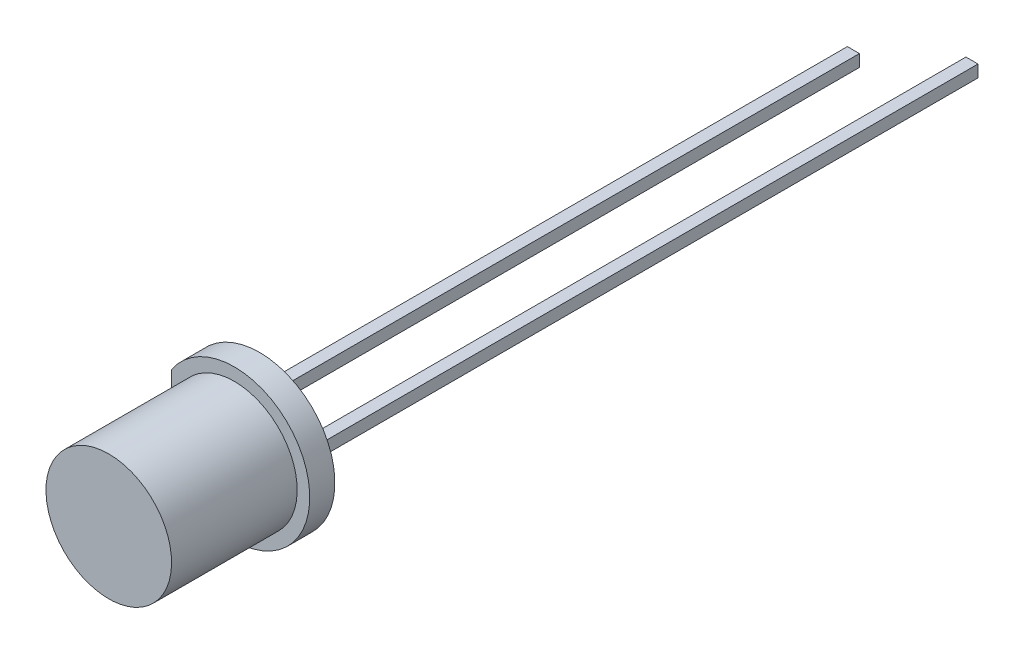
ISO-10303-21;
HEADER;
FILE_DESCRIPTION(('STEP AP214'),'2;1');
FILE_NAME('part.step','',(''),(''),'','','');
FILE_SCHEMA(('AUTOMOTIVE_DESIGN { 1 0 10303 214 1 1 1 1 }'));
ENDSEC;
DATA;
#1=APPLICATION_CONTEXT('core data for automotive mechanical design processes');
#2=APPLICATION_PROTOCOL_DEFINITION('international standard','automotive_design',2000,#1);
#3=PRODUCT_CONTEXT('',#1,'mechanical');
#4=PRODUCT('Part','Part','',(#3));
#5=PRODUCT_RELATED_PRODUCT_CATEGORY('part','',(#4));
#6=PRODUCT_DEFINITION_FORMATION('','',#4);
#7=PRODUCT_DEFINITION_CONTEXT('part definition',#1,'design');
#8=PRODUCT_DEFINITION('design','',#6,#7);
#9=PRODUCT_DEFINITION_SHAPE('','',#8);
#10=(LENGTH_UNIT() NAMED_UNIT(*) SI_UNIT(.MILLI.,.METRE.));
#11=(NAMED_UNIT(*) PLANE_ANGLE_UNIT() SI_UNIT($,.RADIAN.));
#12=(NAMED_UNIT(*) SI_UNIT($,.STERADIAN.) SOLID_ANGLE_UNIT());
#13=UNCERTAINTY_MEASURE_WITH_UNIT(LENGTH_MEASURE(1.E-05),#10,'distance_accuracy_value','');
#14=(GEOMETRIC_REPRESENTATION_CONTEXT(3) GLOBAL_UNCERTAINTY_ASSIGNED_CONTEXT((#13)) GLOBAL_UNIT_ASSIGNED_CONTEXT((#10,
#11,#12)) REPRESENTATION_CONTEXT('',''));
#15=CARTESIAN_POINT('',(0.,0.,0.));
#16=DIRECTION('',(0.,0.,1.));
#17=DIRECTION('',(1.,0.,0.));
#18=AXIS2_PLACEMENT_3D('',#15,#16,#17);
#19=CARTESIAN_POINT('',(-0.0499999999999997,0.,4.26666666666667));
#20=DIRECTION('',(0.,0.,1.));
#21=DIRECTION('',(-1.,0.,0.));
#22=AXIS2_PLACEMENT_3D('',#19,#20,#21);
#23=SPHERICAL_SURFACE('',#22,0.566666666666667);
#24=CARTESIAN_POINT('',(-0.0499999999999997,-0.24,4.26666666666667));
#25=DIRECTION('',(0.,1.,0.));
#26=DIRECTION('',(0.,0.,1.));
#27=AXIS2_PLACEMENT_3D('',#24,#25,#26);
#28=CIRCLE('',#27,0.513333333333333);
#29=CARTESIAN_POINT('',(-0.488634243989226,-0.24,4.));
#30=VERTEX_POINT('',#29);
#31=CARTESIAN_POINT('',(0.388634243989226,-0.24,4.));
#32=VERTEX_POINT('',#31);
#33=EDGE_CURVE('E161',#30,#32,#28,.F.);
#34=ORIENTED_EDGE('',*,*,#33,.T.);
#35=CARTESIAN_POINT('',(-0.0499999999999997,0.,4.));
#36=DIRECTION('',(0.,0.,1.));
#37=DIRECTION('',(1.,0.,0.));
#38=AXIS2_PLACEMENT_3D('',#35,#36,#37);
#39=CIRCLE('',#38,0.5);
#40=EDGE_CURVE('E56',#30,#32,#39,.T.);
#41=ORIENTED_EDGE('',*,*,#40,.F.);
#42=EDGE_LOOP('',(#34,#41));
#43=FACE_BOUND('',#42,.T.);
#44=ADVANCED_FACE('F48',(#43),#23,.T.);
#45=CARTESIAN_POINT('',(0.388634243989226,0.24,4.));
#46=VERTEX_POINT('',#45);
#47=CARTESIAN_POINT('',(-0.488634243989226,0.24,4.));
#48=VERTEX_POINT('',#47);
#49=EDGE_CURVE('E12',#46,#48,#39,.T.);
#50=ORIENTED_EDGE('',*,*,#49,.F.);
#51=CARTESIAN_POINT('',(-0.0499999999999997,0.24,4.26666666666667));
#52=DIRECTION('',(0.,1.,0.));
#53=DIRECTION('',(0.,0.,1.));
#54=AXIS2_PLACEMENT_3D('',#51,#52,#53);
#55=CIRCLE('',#54,0.513333333333333);
#56=EDGE_CURVE('E183',#48,#46,#55,.F.);
#57=ORIENTED_EDGE('',*,*,#56,.F.);
#58=EDGE_LOOP('',(#50,#57));
#59=FACE_BOUND('',#58,.T.);
#60=ADVANCED_FACE('F50',(#59),#23,.T.);
#61=CARTESIAN_POINT('',(-0.55,0.,4.));
#62=DIRECTION('',(0.,0.,-1.));
#63=DIRECTION('',(-1.,0.,0.));
#64=AXIS2_PLACEMENT_3D('',#61,#62,#63);
#65=PLANE('',#64);
#66=CARTESIAN_POINT('',(-0.0499999999999997,0.,4.));
#67=DIRECTION('',(0.,0.,1.));
#68=DIRECTION('',(1.,0.,0.));
#69=AXIS2_PLACEMENT_3D('',#66,#67,#68);
#70=CIRCLE('',#69,0.2);
#71=CARTESIAN_POINT('',(0.15,0.,4.));
#72=VERTEX_POINT('',#71);
#73=EDGE_CURVE('E256',#72,#72,#70,.T.);
#74=ORIENTED_EDGE('',*,*,#73,.F.);
#75=EDGE_LOOP('',(#74));
#76=FACE_BOUND('',#75,.T.);
#77=ORIENTED_EDGE('',*,*,#49,.T.);
#78=DIRECTION('',(1.,0.,0.));
#79=VECTOR('',#78,1.);
#80=CARTESIAN_POINT('',(-1.3,0.24,4.));
#81=LINE('',#80,#79);
#82=CARTESIAN_POINT('',(-1.3,0.24,4.));
#83=VERTEX_POINT('',#82);
#84=EDGE_CURVE('E102',#83,#48,#81,.T.);
#85=ORIENTED_EDGE('',*,*,#84,.F.);
#86=DIRECTION('',(0.,-1.,0.));
#87=VECTOR('',#86,1.);
#88=CARTESIAN_POINT('',(-1.3,0.24,4.));
#89=LINE('',#88,#87);
#90=CARTESIAN_POINT('',(-1.3,-0.24,4.));
#91=VERTEX_POINT('',#90);
#92=EDGE_CURVE('E160',#83,#91,#89,.T.);
#93=ORIENTED_EDGE('',*,*,#92,.T.);
#94=DIRECTION('',(1.,0.,0.));
#95=VECTOR('',#94,1.);
#96=CARTESIAN_POINT('',(-1.3,-0.24,4.));
#97=LINE('',#96,#95);
#98=EDGE_CURVE('E63',#91,#30,#97,.T.);
#99=ORIENTED_EDGE('',*,*,#98,.T.);
#100=ORIENTED_EDGE('',*,*,#40,.T.);
#101=CARTESIAN_POINT('',(1.2,-0.24,4.));
#102=VERTEX_POINT('',#101);
#103=EDGE_CURVE('E146',#32,#102,#97,.T.);
#104=ORIENTED_EDGE('',*,*,#103,.T.);
#105=DIRECTION('',(0.,-1.,0.));
#106=VECTOR('',#105,1.);
#107=CARTESIAN_POINT('',(1.2,0.24,4.));
#108=LINE('',#107,#106);
#109=CARTESIAN_POINT('',(1.2,0.24,4.));
#110=VERTEX_POINT('',#109);
#111=EDGE_CURVE('E130',#110,#102,#108,.T.);
#112=ORIENTED_EDGE('',*,*,#111,.F.);
#113=EDGE_CURVE('E118',#46,#110,#81,.T.);
#114=ORIENTED_EDGE('',*,*,#113,.F.);
#115=EDGE_LOOP('',(#77,#85,#93,#99,#100,#104,#112,#114));
#116=FACE_BOUND('',#115,.T.);
#117=ADVANCED_FACE('F166',(#76,#116),#65,.F.);
#118=CARTESIAN_POINT('',(0.,0.24,0.));
#119=DIRECTION('',(0.,1.,0.));
#120=DIRECTION('',(0.,0.,1.));
#121=AXIS2_PLACEMENT_3D('',#118,#119,#120);
#122=PLANE('',#121);
#123=ORIENTED_EDGE('',*,*,#84,.T.);
#124=ORIENTED_EDGE('',*,*,#56,.T.);
#125=ORIENTED_EDGE('',*,*,#113,.T.);
#126=DIRECTION('',(-0.508148861978286,0.,-0.861269257590315));
#127=VECTOR('',#126,1.);
#128=CARTESIAN_POINT('',(1.2,0.24,4.));
#129=LINE('',#128,#127);
#130=CARTESIAN_POINT('',(0.0199999999999998,0.24,2.));
#131=VERTEX_POINT('',#130);
#132=EDGE_CURVE('E109',#110,#131,#129,.T.);
#133=ORIENTED_EDGE('',*,*,#132,.T.);
#134=DIRECTION('',(-1.,0.,0.));
#135=VECTOR('',#134,1.);
#136=CARTESIAN_POINT('',(0.0199999999999998,0.24,2.));
#137=LINE('',#136,#135);
#138=CARTESIAN_POINT('',(-1.12,0.24,2.));
#139=VERTEX_POINT('',#138);
#140=EDGE_CURVE('E114',#131,#139,#137,.T.);
#141=ORIENTED_EDGE('',*,*,#140,.T.);
#142=DIRECTION('',(0.,0.,-1.));
#143=VECTOR('',#142,1.);
#144=CARTESIAN_POINT('',(-1.12,0.24,2.));
#145=LINE('',#144,#143);
#146=CARTESIAN_POINT('',(-1.12,0.24,-25.));
#147=VERTEX_POINT('',#146);
#148=EDGE_CURVE('E136',#139,#147,#145,.T.);
#149=ORIENTED_EDGE('',*,*,#148,.T.);
#150=DIRECTION('',(1.,0.,0.));
#151=VECTOR('',#150,1.);
#152=CARTESIAN_POINT('',(-1.12,0.24,-25.));
#153=LINE('',#152,#151);
#154=CARTESIAN_POINT('',(-1.6,0.24,-25.));
#155=VERTEX_POINT('',#154);
#156=EDGE_CURVE('E147',#155,#147,#153,.T.);
#157=ORIENTED_EDGE('',*,*,#156,.F.);
#158=DIRECTION('',(0.,0.,1.));
#159=VECTOR('',#158,1.);
#160=CARTESIAN_POINT('',(-1.6,0.24,0.));
#161=LINE('',#160,#159);
#162=CARTESIAN_POINT('',(-1.6,0.24,3.5));
#163=VERTEX_POINT('',#162);
#164=EDGE_CURVE('E72',#155,#163,#161,.T.);
#165=ORIENTED_EDGE('',*,*,#164,.T.);
#166=DIRECTION('',(0.514495755427526,0.,0.857492925712544));
#167=VECTOR('',#166,1.);
#168=CARTESIAN_POINT('',(-1.6,0.24,3.5));
#169=LINE('',#168,#167);
#170=EDGE_CURVE('E156',#163,#83,#169,.T.);
#171=ORIENTED_EDGE('',*,*,#170,.T.);
#172=EDGE_LOOP('',(#123,#124,#125,#133,#141,#149,#157,#165,#171));
#173=FACE_BOUND('',#172,.T.);
#174=ADVANCED_FACE('F111',(#173),#122,.T.);
#175=CARTESIAN_POINT('',(0.,-0.24,0.));
#176=DIRECTION('',(0.,1.,0.));
#177=DIRECTION('',(0.,0.,1.));
#178=AXIS2_PLACEMENT_3D('',#175,#176,#177);
#179=PLANE('',#178);
#180=ORIENTED_EDGE('',*,*,#33,.F.);
#181=ORIENTED_EDGE('',*,*,#98,.F.);
#182=DIRECTION('',(0.514495755427526,0.,0.857492925712544));
#183=VECTOR('',#182,1.);
#184=CARTESIAN_POINT('',(-1.6,-0.24,3.5));
#185=LINE('',#184,#183);
#186=CARTESIAN_POINT('',(-1.6,-0.24,3.5));
#187=VERTEX_POINT('',#186);
#188=EDGE_CURVE('E143',#187,#91,#185,.T.);
#189=ORIENTED_EDGE('',*,*,#188,.F.);
#190=DIRECTION('',(0.,0.,1.));
#191=VECTOR('',#190,1.);
#192=CARTESIAN_POINT('',(-1.6,-0.24,0.));
#193=LINE('',#192,#191);
#194=CARTESIAN_POINT('',(-1.6,-0.24,-25.));
#195=VERTEX_POINT('',#194);
#196=EDGE_CURVE('E96',#195,#187,#193,.T.);
#197=ORIENTED_EDGE('',*,*,#196,.F.);
#198=DIRECTION('',(-1.,0.,0.));
#199=VECTOR('',#198,1.);
#200=CARTESIAN_POINT('',(-1.12,-0.24,-25.));
#201=LINE('',#200,#199);
#202=CARTESIAN_POINT('',(-1.12,-0.24,-25.));
#203=VERTEX_POINT('',#202);
#204=EDGE_CURVE('E204',#203,#195,#201,.T.);
#205=ORIENTED_EDGE('',*,*,#204,.F.);
#206=DIRECTION('',(0.,0.,-1.));
#207=VECTOR('',#206,1.);
#208=CARTESIAN_POINT('',(-1.12,-0.24,2.));
#209=LINE('',#208,#207);
#210=CARTESIAN_POINT('',(-1.12,-0.24,2.));
#211=VERTEX_POINT('',#210);
#212=EDGE_CURVE('E152',#211,#203,#209,.T.);
#213=ORIENTED_EDGE('',*,*,#212,.F.);
#214=DIRECTION('',(-1.,0.,0.));
#215=VECTOR('',#214,1.);
#216=CARTESIAN_POINT('',(0.0199999999999998,-0.24,2.));
#217=LINE('',#216,#215);
#218=CARTESIAN_POINT('',(0.0199999999999998,-0.24,2.));
#219=VERTEX_POINT('',#218);
#220=EDGE_CURVE('E150',#219,#211,#217,.T.);
#221=ORIENTED_EDGE('',*,*,#220,.F.);
#222=DIRECTION('',(-0.508148861978286,0.,-0.861269257590315));
#223=VECTOR('',#222,1.);
#224=CARTESIAN_POINT('',(1.2,-0.24,4.));
#225=LINE('',#224,#223);
#226=EDGE_CURVE('E127',#102,#219,#225,.T.);
#227=ORIENTED_EDGE('',*,*,#226,.F.);
#228=ORIENTED_EDGE('',*,*,#103,.F.);
#229=EDGE_LOOP('',(#180,#181,#189,#197,#205,#213,#221,#227,#228));
#230=FACE_BOUND('',#229,.T.);
#231=ADVANCED_FACE('F218',(#230),#179,.F.);
#232=CARTESIAN_POINT('',(-1.6,0.24,3.5));
#233=DIRECTION('',(0.857492925712544,0.,-0.514495755427526));
#234=DIRECTION('',(-0.514495755427526,0.,-0.857492925712544));
#235=AXIS2_PLACEMENT_3D('',#232,#233,#234);
#236=PLANE('',#235);
#237=ORIENTED_EDGE('',*,*,#188,.T.);
#238=ORIENTED_EDGE('',*,*,#92,.F.);
#239=ORIENTED_EDGE('',*,*,#170,.F.);
#240=DIRECTION('',(0.,-1.,0.));
#241=VECTOR('',#240,1.);
#242=CARTESIAN_POINT('',(-1.6,0.24,3.5));
#243=LINE('',#242,#241);
#244=EDGE_CURVE('E142',#163,#187,#243,.T.);
#245=ORIENTED_EDGE('',*,*,#244,.T.);
#246=EDGE_LOOP('',(#237,#238,#239,#245));
#247=FACE_BOUND('',#246,.T.);
#248=ADVANCED_FACE('F215',(#247),#236,.F.);
#249=CARTESIAN_POINT('',(1.2,0.24,4.));
#250=DIRECTION('',(-0.861269257590315,0.,0.508148861978286));
#251=DIRECTION('',(0.508148861978286,0.,0.861269257590315));
#252=AXIS2_PLACEMENT_3D('',#249,#250,#251);
#253=PLANE('',#252);
#254=ORIENTED_EDGE('',*,*,#226,.T.);
#255=DIRECTION('',(0.,-1.,0.));
#256=VECTOR('',#255,1.);
#257=CARTESIAN_POINT('',(0.0199999999999998,0.24,2.));
#258=LINE('',#257,#256);
#259=EDGE_CURVE('E124',#131,#219,#258,.T.);
#260=ORIENTED_EDGE('',*,*,#259,.F.);
#261=ORIENTED_EDGE('',*,*,#132,.F.);
#262=ORIENTED_EDGE('',*,*,#111,.T.);
#263=EDGE_LOOP('',(#254,#260,#261,#262));
#264=FACE_BOUND('',#263,.T.);
#265=ADVANCED_FACE('F125',(#264),#253,.F.);
#266=CARTESIAN_POINT('',(0.0199999999999998,0.24,2.));
#267=DIRECTION('',(0.,0.,1.));
#268=DIRECTION('',(1.,0.,0.));
#269=AXIS2_PLACEMENT_3D('',#266,#267,#268);
#270=PLANE('',#269);
#271=ORIENTED_EDGE('',*,*,#220,.T.);
#272=DIRECTION('',(0.,-1.,0.));
#273=VECTOR('',#272,1.);
#274=CARTESIAN_POINT('',(-1.12,0.24,2.));
#275=LINE('',#274,#273);
#276=EDGE_CURVE('E131',#139,#211,#275,.T.);
#277=ORIENTED_EDGE('',*,*,#276,.F.);
#278=ORIENTED_EDGE('',*,*,#140,.F.);
#279=ORIENTED_EDGE('',*,*,#259,.T.);
#280=EDGE_LOOP('',(#271,#277,#278,#279));
#281=FACE_BOUND('',#280,.T.);
#282=ADVANCED_FACE('F133',(#281),#270,.F.);
#283=CARTESIAN_POINT('',(-1.12,0.24,2.));
#284=DIRECTION('',(-1.,0.,0.));
#285=DIRECTION('',(0.,0.,1.));
#286=AXIS2_PLACEMENT_3D('',#283,#284,#285);
#287=PLANE('',#286);
#288=ORIENTED_EDGE('',*,*,#212,.T.);
#289=DIRECTION('',(0.,-1.,0.));
#290=VECTOR('',#289,1.);
#291=CARTESIAN_POINT('',(-1.12,-0.24,-25.));
#292=LINE('',#291,#290);
#293=EDGE_CURVE('E198',#147,#203,#292,.T.);
#294=ORIENTED_EDGE('',*,*,#293,.F.);
#295=ORIENTED_EDGE('',*,*,#148,.F.);
#296=ORIENTED_EDGE('',*,*,#276,.T.);
#297=EDGE_LOOP('',(#288,#294,#295,#296));
#298=FACE_BOUND('',#297,.T.);
#299=ADVANCED_FACE('F201',(#298),#287,.F.);
#300=CARTESIAN_POINT('',(-1.6,0.24,0.));
#301=DIRECTION('',(1.,0.,0.));
#302=DIRECTION('',(0.,0.,-1.));
#303=AXIS2_PLACEMENT_3D('',#300,#301,#302);
#304=PLANE('',#303);
#305=ORIENTED_EDGE('',*,*,#196,.T.);
#306=ORIENTED_EDGE('',*,*,#244,.F.);
#307=ORIENTED_EDGE('',*,*,#164,.F.);
#308=DIRECTION('',(0.,1.,0.));
#309=VECTOR('',#308,1.);
#310=CARTESIAN_POINT('',(-1.6,-0.24,-25.));
#311=LINE('',#310,#309);
#312=EDGE_CURVE('E199',#195,#155,#311,.T.);
#313=ORIENTED_EDGE('',*,*,#312,.F.);
#314=EDGE_LOOP('',(#305,#306,#307,#313));
#315=FACE_BOUND('',#314,.T.);
#316=ADVANCED_FACE('F219',(#315),#304,.F.);
#317=CARTESIAN_POINT('',(0.,0.,-25.));
#318=DIRECTION('',(0.,0.,1.));
#319=DIRECTION('',(1.,0.,0.));
#320=AXIS2_PLACEMENT_3D('',#317,#318,#319);
#321=PLANE('',#320);
#322=ORIENTED_EDGE('',*,*,#293,.T.);
#323=ORIENTED_EDGE('',*,*,#204,.T.);
#324=ORIENTED_EDGE('',*,*,#312,.T.);
#325=ORIENTED_EDGE('',*,*,#156,.T.);
#326=EDGE_LOOP('',(#322,#323,#324,#325));
#327=FACE_BOUND('',#326,.T.);
#328=ADVANCED_FACE('F196',(#327),#321,.F.);
#329=CARTESIAN_POINT('',(-0.0499999999999997,0.,3.9));
#330=DIRECTION('',(0.,0.,1.));
#331=DIRECTION('',(1.,0.,0.));
#332=AXIS2_PLACEMENT_3D('',#329,#330,#331);
#333=CYLINDRICAL_SURFACE('',#332,0.2);
#334=CARTESIAN_POINT('',(-0.0499999999999997,0.,3.9));
#335=DIRECTION('',(0.,0.,1.));
#336=DIRECTION('',(1.,0.,0.));
#337=AXIS2_PLACEMENT_3D('',#334,#335,#336);
#338=CIRCLE('',#337,0.2);
#339=CARTESIAN_POINT('',(0.15,0.,3.9));
#340=VERTEX_POINT('',#339);
#341=EDGE_CURVE('E207',#340,#340,#338,.T.);
#342=ORIENTED_EDGE('',*,*,#341,.F.);
#343=EDGE_LOOP('',(#342));
#344=FACE_BOUND('',#343,.T.);
#345=ORIENTED_EDGE('',*,*,#73,.T.);
#346=EDGE_LOOP('',(#345));
#347=FACE_BOUND('',#346,.T.);
#348=ADVANCED_FACE('F226',(#344,#347),#333,.F.);
#349=CARTESIAN_POINT('',(-0.0499999999999997,0.,3.9));
#350=DIRECTION('',(0.,0.,1.));
#351=DIRECTION('',(1.,0.,0.));
#352=AXIS2_PLACEMENT_3D('',#349,#350,#351);
#353=PLANE('',#352);
#354=ORIENTED_EDGE('',*,*,#341,.T.);
#355=EDGE_LOOP('',(#354));
#356=FACE_BOUND('',#355,.T.);
#357=ADVANCED_FACE('F248',(#356),#353,.T.);
#358=CLOSED_SHELL('',(#44,#60,#117,#174,#231,#248,#265,#282,#299,#316,#328,#348,#357));
#359=MANIFOLD_SOLID_BREP('B2',#358);
#360=CARTESIAN_POINT('',(1.12,0.24,2.));
#361=DIRECTION('',(0.,0.,1.));
#362=DIRECTION('',(1.,0.,0.));
#363=AXIS2_PLACEMENT_3D('',#360,#361,#362);
#364=PLANE('',#363);
#365=DIRECTION('',(-1.,0.,0.));
#366=VECTOR('',#365,1.);
#367=CARTESIAN_POINT('',(1.12,-0.24,2.));
#368=LINE('',#367,#366);
#369=CARTESIAN_POINT('',(1.12,-0.24,2.));
#370=VERTEX_POINT('',#369);
#371=CARTESIAN_POINT('',(0.22,-0.24,2.));
#372=VERTEX_POINT('',#371);
#373=EDGE_CURVE('E454',#370,#372,#368,.T.);
#374=ORIENTED_EDGE('',*,*,#373,.T.);
#375=DIRECTION('',(0.,-1.,0.));
#376=VECTOR('',#375,1.);
#377=CARTESIAN_POINT('',(0.22,0.24,2.));
#378=LINE('',#377,#376);
#379=CARTESIAN_POINT('',(0.22,0.24,2.));
#380=VERTEX_POINT('',#379);
#381=EDGE_CURVE('E46',#380,#372,#378,.T.);
#382=ORIENTED_EDGE('',*,*,#381,.F.);
#383=DIRECTION('',(-1.,0.,0.));
#384=VECTOR('',#383,1.);
#385=CARTESIAN_POINT('',(1.12,0.24,2.));
#386=LINE('',#385,#384);
#387=CARTESIAN_POINT('',(1.12,0.24,2.));
#388=VERTEX_POINT('',#387);
#389=EDGE_CURVE('E455',#388,#380,#386,.T.);
#390=ORIENTED_EDGE('',*,*,#389,.F.);
#391=DIRECTION('',(0.,-1.,0.));
#392=VECTOR('',#391,1.);
#393=CARTESIAN_POINT('',(1.12,0.24,2.));
#394=LINE('',#393,#392);
#395=EDGE_CURVE('E460',#388,#370,#394,.T.);
#396=ORIENTED_EDGE('',*,*,#395,.T.);
#397=EDGE_LOOP('',(#374,#382,#390,#396));
#398=FACE_BOUND('',#397,.T.);
#399=ADVANCED_FACE('F368',(#398),#364,.F.);
#400=CARTESIAN_POINT('',(0.22,0.24,2.));
#401=DIRECTION('',(0.861269257590315,0.,-0.508148861978286));
#402=DIRECTION('',(-0.508148861978286,0.,-0.861269257590315));
#403=AXIS2_PLACEMENT_3D('',#400,#401,#402);
#404=PLANE('',#403);
#405=DIRECTION('',(0.508148861978286,0.,0.861269257590315));
#406=VECTOR('',#405,1.);
#407=CARTESIAN_POINT('',(0.22,-0.24,2.));
#408=LINE('',#407,#406);
#409=CARTESIAN_POINT('',(1.4,-0.24,4.));
#410=VERTEX_POINT('',#409);
#411=EDGE_CURVE('E463',#372,#410,#408,.T.);
#412=ORIENTED_EDGE('',*,*,#411,.T.);
#413=DIRECTION('',(0.,-1.,0.));
#414=VECTOR('',#413,1.);
#415=CARTESIAN_POINT('',(1.4,0.24,4.));
#416=LINE('',#415,#414);
#417=CARTESIAN_POINT('',(1.4,0.24,4.));
#418=VERTEX_POINT('',#417);
#419=EDGE_CURVE('E376',#418,#410,#416,.T.);
#420=ORIENTED_EDGE('',*,*,#419,.F.);
#421=DIRECTION('',(0.508148861978286,0.,0.861269257590315));
#422=VECTOR('',#421,1.);
#423=CARTESIAN_POINT('',(0.22,0.24,2.));
#424=LINE('',#423,#422);
#425=EDGE_CURVE('E417',#380,#418,#424,.T.);
#426=ORIENTED_EDGE('',*,*,#425,.F.);
#427=ORIENTED_EDGE('',*,*,#381,.T.);
#428=EDGE_LOOP('',(#412,#420,#426,#427));
#429=FACE_BOUND('',#428,.T.);
#430=ADVANCED_FACE('F478',(#429),#404,.F.);
#431=CARTESIAN_POINT('',(1.4,0.24,4.));
#432=DIRECTION('',(0.,0.,-1.));
#433=DIRECTION('',(-1.,0.,0.));
#434=AXIS2_PLACEMENT_3D('',#431,#432,#433);
#435=PLANE('',#434);
#436=DIRECTION('',(1.,0.,0.));
#437=VECTOR('',#436,1.);
#438=CARTESIAN_POINT('',(1.4,-0.24,4.));
#439=LINE('',#438,#437);
#440=CARTESIAN_POINT('',(1.6,-0.24,4.));
#441=VERTEX_POINT('',#440);
#442=EDGE_CURVE('E403',#410,#441,#439,.T.);
#443=ORIENTED_EDGE('',*,*,#442,.T.);
#444=DIRECTION('',(0.,-1.,0.));
#445=VECTOR('',#444,1.);
#446=CARTESIAN_POINT('',(1.6,0.24,4.));
#447=LINE('',#446,#445);
#448=CARTESIAN_POINT('',(1.6,0.24,4.));
#449=VERTEX_POINT('',#448);
#450=EDGE_CURVE('E469',#449,#441,#447,.T.);
#451=ORIENTED_EDGE('',*,*,#450,.F.);
#452=DIRECTION('',(1.,0.,0.));
#453=VECTOR('',#452,1.);
#454=CARTESIAN_POINT('',(1.4,0.24,4.));
#455=LINE('',#454,#453);
#456=EDGE_CURVE('E434',#418,#449,#455,.T.);
#457=ORIENTED_EDGE('',*,*,#456,.F.);
#458=ORIENTED_EDGE('',*,*,#419,.T.);
#459=EDGE_LOOP('',(#443,#451,#457,#458));
#460=FACE_BOUND('',#459,.T.);
#461=ADVANCED_FACE('F470',(#460),#435,.F.);
#462=CARTESIAN_POINT('',(1.6,0.24,4.));
#463=DIRECTION('',(-1.,0.,0.));
#464=DIRECTION('',(0.,0.,1.));
#465=AXIS2_PLACEMENT_3D('',#462,#463,#464);
#466=PLANE('',#465);
#467=DIRECTION('',(0.,0.,-1.));
#468=VECTOR('',#467,1.);
#469=CARTESIAN_POINT('',(1.6,-0.24,4.));
#470=LINE('',#469,#468);
#471=CARTESIAN_POINT('',(1.6,-0.24,-27.));
#472=VERTEX_POINT('',#471);
#473=EDGE_CURVE('E441',#441,#472,#470,.T.);
#474=ORIENTED_EDGE('',*,*,#473,.T.);
#475=DIRECTION('',(0.,-1.,0.));
#476=VECTOR('',#475,1.);
#477=CARTESIAN_POINT('',(1.6,0.24,-27.));
#478=LINE('',#477,#476);
#479=CARTESIAN_POINT('',(1.6,0.24,-27.));
#480=VERTEX_POINT('',#479);
#481=EDGE_CURVE('E438',#480,#472,#478,.T.);
#482=ORIENTED_EDGE('',*,*,#481,.F.);
#483=DIRECTION('',(0.,0.,-1.));
#484=VECTOR('',#483,1.);
#485=CARTESIAN_POINT('',(1.6,0.24,4.));
#486=LINE('',#485,#484);
#487=EDGE_CURVE('E428',#449,#480,#486,.T.);
#488=ORIENTED_EDGE('',*,*,#487,.F.);
#489=ORIENTED_EDGE('',*,*,#450,.T.);
#490=EDGE_LOOP('',(#474,#482,#488,#489));
#491=FACE_BOUND('',#490,.T.);
#492=ADVANCED_FACE('F439',(#491),#466,.F.);
#493=CARTESIAN_POINT('',(1.12,0.24,0.));
#494=DIRECTION('',(1.,0.,0.));
#495=DIRECTION('',(0.,0.,-1.));
#496=AXIS2_PLACEMENT_3D('',#493,#494,#495);
#497=PLANE('',#496);
#498=DIRECTION('',(0.,0.,1.));
#499=VECTOR('',#498,1.);
#500=CARTESIAN_POINT('',(1.12,-0.24,0.));
#501=LINE('',#500,#499);
#502=CARTESIAN_POINT('',(1.12,-0.24,-27.));
#503=VERTEX_POINT('',#502);
#504=EDGE_CURVE('E410',#503,#370,#501,.T.);
#505=ORIENTED_EDGE('',*,*,#504,.T.);
#506=ORIENTED_EDGE('',*,*,#395,.F.);
#507=DIRECTION('',(0.,0.,1.));
#508=VECTOR('',#507,1.);
#509=CARTESIAN_POINT('',(1.12,0.24,0.));
#510=LINE('',#509,#508);
#511=CARTESIAN_POINT('',(1.12,0.24,-27.));
#512=VERTEX_POINT('',#511);
#513=EDGE_CURVE('E384',#512,#388,#510,.T.);
#514=ORIENTED_EDGE('',*,*,#513,.F.);
#515=DIRECTION('',(0.,1.,0.));
#516=VECTOR('',#515,1.);
#517=CARTESIAN_POINT('',(1.12,-0.24,-27.));
#518=LINE('',#517,#516);
#519=EDGE_CURVE('E449',#503,#512,#518,.T.);
#520=ORIENTED_EDGE('',*,*,#519,.F.);
#521=EDGE_LOOP('',(#505,#506,#514,#520));
#522=FACE_BOUND('',#521,.T.);
#523=ADVANCED_FACE('F474',(#522),#497,.F.);
#524=CARTESIAN_POINT('',(0.,0.24,0.));
#525=DIRECTION('',(0.,-1.,0.));
#526=DIRECTION('',(0.,0.,-1.));
#527=AXIS2_PLACEMENT_3D('',#524,#525,#526);
#528=PLANE('',#527);
#529=ORIENTED_EDGE('',*,*,#389,.T.);
#530=ORIENTED_EDGE('',*,*,#425,.T.);
#531=ORIENTED_EDGE('',*,*,#456,.T.);
#532=ORIENTED_EDGE('',*,*,#487,.T.);
#533=DIRECTION('',(1.,0.,0.));
#534=VECTOR('',#533,1.);
#535=CARTESIAN_POINT('',(1.12,0.24,-27.));
#536=LINE('',#535,#534);
#537=EDGE_CURVE('E432',#512,#480,#536,.T.);
#538=ORIENTED_EDGE('',*,*,#537,.F.);
#539=ORIENTED_EDGE('',*,*,#513,.T.);
#540=EDGE_LOOP('',(#529,#530,#531,#532,#538,#539));
#541=FACE_BOUND('',#540,.T.);
#542=ADVANCED_FACE('F430',(#541),#528,.F.);
#543=CARTESIAN_POINT('',(0.,-0.24,0.));
#544=DIRECTION('',(0.,-1.,0.));
#545=DIRECTION('',(0.,0.,-1.));
#546=AXIS2_PLACEMENT_3D('',#543,#544,#545);
#547=PLANE('',#546);
#548=ORIENTED_EDGE('',*,*,#373,.F.);
#549=ORIENTED_EDGE('',*,*,#504,.F.);
#550=DIRECTION('',(-1.,0.,0.));
#551=VECTOR('',#550,1.);
#552=CARTESIAN_POINT('',(1.6,-0.24,-27.));
#553=LINE('',#552,#551);
#554=EDGE_CURVE('E445',#472,#503,#553,.T.);
#555=ORIENTED_EDGE('',*,*,#554,.F.);
#556=ORIENTED_EDGE('',*,*,#473,.F.);
#557=ORIENTED_EDGE('',*,*,#442,.F.);
#558=ORIENTED_EDGE('',*,*,#411,.F.);
#559=EDGE_LOOP('',(#548,#549,#555,#556,#557,#558));
#560=FACE_BOUND('',#559,.T.);
#561=ADVANCED_FACE('F473',(#560),#547,.T.);
#562=CARTESIAN_POINT('',(0.,0.,-27.));
#563=DIRECTION('',(0.,0.,-1.));
#564=DIRECTION('',(-1.,0.,0.));
#565=AXIS2_PLACEMENT_3D('',#562,#563,#564);
#566=PLANE('',#565);
#567=ORIENTED_EDGE('',*,*,#537,.T.);
#568=ORIENTED_EDGE('',*,*,#481,.T.);
#569=ORIENTED_EDGE('',*,*,#554,.T.);
#570=ORIENTED_EDGE('',*,*,#519,.T.);
#571=EDGE_LOOP('',(#567,#568,#569,#570));
#572=FACE_BOUND('',#571,.T.);
#573=ADVANCED_FACE('F448',(#572),#566,.T.);
#574=CLOSED_SHELL('',(#399,#430,#461,#492,#523,#542,#561,#573));
#575=MANIFOLD_SOLID_BREP('B6',#574);
#576=CARTESIAN_POINT('',(0.,0.,1.));
#577=DIRECTION('',(0.,0.,-1.));
#578=DIRECTION('',(-1.,0.,0.));
#579=AXIS2_PLACEMENT_3D('',#576,#577,#578);
#580=CYLINDRICAL_SURFACE('',#579,3.);
#581=CARTESIAN_POINT('',(0.,0.,1.));
#582=DIRECTION('',(0.,0.,1.));
#583=DIRECTION('',(1.,0.,0.));
#584=AXIS2_PLACEMENT_3D('',#581,#582,#583);
#585=CIRCLE('',#584,3.);
#586=CARTESIAN_POINT('',(-2.5,-1.6583123951777,1.));
#587=VERTEX_POINT('',#586);
#588=CARTESIAN_POINT('',(-2.5,1.6583123951777,1.));
#589=VERTEX_POINT('',#588);
#590=EDGE_CURVE('E580',#587,#589,#585,.T.);
#591=ORIENTED_EDGE('',*,*,#590,.F.);
#592=DIRECTION('',(0.,0.,-1.));
#593=VECTOR('',#592,1.);
#594=CARTESIAN_POINT('',(-2.5,-1.6583123951777,4.35410196624969));
#595=LINE('',#594,#593);
#596=CARTESIAN_POINT('',(-2.5,-1.6583123951777,0.));
#597=VERTEX_POINT('',#596);
#598=EDGE_CURVE('E778',#587,#597,#595,.T.);
#599=ORIENTED_EDGE('',*,*,#598,.T.);
#600=CARTESIAN_POINT('',(0.,0.,0.));
#601=DIRECTION('',(0.,0.,1.));
#602=DIRECTION('',(1.,0.,0.));
#603=AXIS2_PLACEMENT_3D('',#600,#601,#602);
#604=CIRCLE('',#603,3.);
#605=CARTESIAN_POINT('',(-2.5,1.6583123951777,0.));
#606=VERTEX_POINT('',#605);
#607=EDGE_CURVE('E786',#597,#606,#604,.T.);
#608=ORIENTED_EDGE('',*,*,#607,.T.);
#609=DIRECTION('',(0.,0.,-1.));
#610=VECTOR('',#609,1.);
#611=CARTESIAN_POINT('',(-2.5,1.6583123951777,4.35410196624969));
#612=LINE('',#611,#610);
#613=EDGE_CURVE('E781',#589,#606,#612,.T.);
#614=ORIENTED_EDGE('',*,*,#613,.F.);
#615=EDGE_LOOP('',(#591,#599,#608,#614));
#616=FACE_BOUND('',#615,.T.);
#617=ADVANCED_FACE('F573',(#616),#580,.T.);
#618=CARTESIAN_POINT('',(0.,0.,1.));
#619=DIRECTION('',(0.,0.,1.));
#620=DIRECTION('',(1.,0.,0.));
#621=AXIS2_PLACEMENT_3D('',#618,#619,#620);
#622=PLANE('',#621);
#623=DIRECTION('',(0.,-1.,0.));
#624=VECTOR('',#623,1.);
#625=CARTESIAN_POINT('',(-2.5,1.6583123951777,1.));
#626=LINE('',#625,#624);
#627=CARTESIAN_POINT('',(-2.5,0.,1.));
#628=VERTEX_POINT('',#627);
#629=EDGE_CURVE('E774',#628,#587,#626,.T.);
#630=ORIENTED_EDGE('',*,*,#629,.T.);
#631=ORIENTED_EDGE('',*,*,#590,.T.);
#632=EDGE_CURVE('E775',#589,#628,#626,.T.);
#633=ORIENTED_EDGE('',*,*,#632,.T.);
#634=CARTESIAN_POINT('',(0.,0.,1.));
#635=DIRECTION('',(0.,0.,1.));
#636=DIRECTION('',(1.,0.,0.));
#637=AXIS2_PLACEMENT_3D('',#634,#635,#636);
#638=CIRCLE('',#637,2.5);
#639=EDGE_CURVE('E366',#628,#628,#638,.T.);
#640=ORIENTED_EDGE('',*,*,#639,.F.);
#641=EDGE_LOOP('',(#630,#631,#633,#640));
#642=FACE_BOUND('',#641,.T.);
#643=ADVANCED_FACE('F800',(#642),#622,.T.);
#644=CARTESIAN_POINT('',(0.,0.,0.));
#645=DIRECTION('',(0.,0.,1.));
#646=DIRECTION('',(1.,0.,0.));
#647=AXIS2_PLACEMENT_3D('',#644,#645,#646);
#648=PLANE('',#647);
#649=DIRECTION('',(0.,1.,0.));
#650=VECTOR('',#649,1.);
#651=CARTESIAN_POINT('',(1.12,-0.24,0.));
#652=LINE('',#651,#650);
#653=CARTESIAN_POINT('',(1.12,-0.24,0.));
#654=VERTEX_POINT('',#653);
#655=CARTESIAN_POINT('',(1.12,0.24,0.));
#656=VERTEX_POINT('',#655);
#657=EDGE_CURVE('E687',#654,#656,#652,.T.);
#658=ORIENTED_EDGE('',*,*,#657,.F.);
#659=DIRECTION('',(-1.,0.,0.));
#660=VECTOR('',#659,1.);
#661=CARTESIAN_POINT('',(1.12,-0.24,0.));
#662=LINE('',#661,#660);
#663=CARTESIAN_POINT('',(1.6,-0.24,0.));
#664=VERTEX_POINT('',#663);
#665=EDGE_CURVE('E694',#664,#654,#662,.T.);
#666=ORIENTED_EDGE('',*,*,#665,.F.);
#667=DIRECTION('',(0.,1.,0.));
#668=VECTOR('',#667,1.);
#669=CARTESIAN_POINT('',(1.6,-0.24,0.));
#670=LINE('',#669,#668);
#671=CARTESIAN_POINT('',(1.6,0.24,0.));
#672=VERTEX_POINT('',#671);
#673=EDGE_CURVE('E742',#664,#672,#670,.T.);
#674=ORIENTED_EDGE('',*,*,#673,.T.);
#675=DIRECTION('',(-1.,0.,0.));
#676=VECTOR('',#675,1.);
#677=CARTESIAN_POINT('',(1.12,0.24,0.));
#678=LINE('',#677,#676);
#679=EDGE_CURVE('E708',#672,#656,#678,.T.);
#680=ORIENTED_EDGE('',*,*,#679,.T.);
#681=EDGE_LOOP('',(#658,#666,#674,#680));
#682=FACE_BOUND('',#681,.T.);
#683=DIRECTION('',(0.,1.,0.));
#684=VECTOR('',#683,1.);
#685=CARTESIAN_POINT('',(-1.6,-0.24,0.));
#686=LINE('',#685,#684);
#687=CARTESIAN_POINT('',(-1.6,-0.24,0.));
#688=VERTEX_POINT('',#687);
#689=CARTESIAN_POINT('',(-1.6,0.24,0.));
#690=VERTEX_POINT('',#689);
#691=EDGE_CURVE('E738',#688,#690,#686,.T.);
#692=ORIENTED_EDGE('',*,*,#691,.F.);
#693=DIRECTION('',(-1.,0.,0.));
#694=VECTOR('',#693,1.);
#695=CARTESIAN_POINT('',(-1.6,-0.24,0.));
#696=LINE('',#695,#694);
#697=CARTESIAN_POINT('',(-1.12,-0.24,0.));
#698=VERTEX_POINT('',#697);
#699=EDGE_CURVE('E716',#698,#688,#696,.T.);
#700=ORIENTED_EDGE('',*,*,#699,.F.);
#701=DIRECTION('',(0.,1.,0.));
#702=VECTOR('',#701,1.);
#703=CARTESIAN_POINT('',(-1.12,-0.24,0.));
#704=LINE('',#703,#702);
#705=CARTESIAN_POINT('',(-1.12,0.24,0.));
#706=VERTEX_POINT('',#705);
#707=EDGE_CURVE('E758',#698,#706,#704,.T.);
#708=ORIENTED_EDGE('',*,*,#707,.T.);
#709=DIRECTION('',(-1.,0.,0.));
#710=VECTOR('',#709,1.);
#711=CARTESIAN_POINT('',(-1.6,0.24,0.));
#712=LINE('',#711,#710);
#713=EDGE_CURVE('E739',#706,#690,#712,.T.);
#714=ORIENTED_EDGE('',*,*,#713,.T.);
#715=EDGE_LOOP('',(#692,#700,#708,#714));
#716=FACE_BOUND('',#715,.T.);
#717=ORIENTED_EDGE('',*,*,#607,.F.);
#718=DIRECTION('',(0.,-1.,0.));
#719=VECTOR('',#718,1.);
#720=CARTESIAN_POINT('',(-2.5,1.6583123951777,0.));
#721=LINE('',#720,#719);
#722=EDGE_CURVE('E761',#606,#597,#721,.T.);
#723=ORIENTED_EDGE('',*,*,#722,.F.);
#724=EDGE_LOOP('',(#717,#723));
#725=FACE_BOUND('',#724,.T.);
#726=ADVANCED_FACE('F706',(#682,#716,#725),#648,.F.);
#727=CARTESIAN_POINT('',(0.,0.,6.));
#728=DIRECTION('',(0.,0.,1.));
#729=DIRECTION('',(0.,-1.,0.));
#730=AXIS2_PLACEMENT_3D('',#727,#728,#729);
#731=PLANE('',#730);
#732=CARTESIAN_POINT('',(0.,0.,6.));
#733=DIRECTION('',(0.,0.,-1.));
#734=DIRECTION('',(0.,1.,0.));
#735=AXIS2_PLACEMENT_3D('',#732,#733,#734);
#736=CIRCLE('',#735,2.5);
#737=CARTESIAN_POINT('',(0.,2.5,6.));
#738=VERTEX_POINT('',#737);
#739=EDGE_CURVE('E783',#738,#738,#736,.T.);
#740=ORIENTED_EDGE('',*,*,#739,.F.);
#741=EDGE_LOOP('',(#740));
#742=FACE_BOUND('',#741,.T.);
#743=ADVANCED_FACE('F804',(#742),#731,.T.);
#744=CARTESIAN_POINT('',(0.,0.,1.));
#745=DIRECTION('',(0.,0.,-1.));
#746=DIRECTION('',(0.,1.,0.));
#747=AXIS2_PLACEMENT_3D('',#744,#745,#746);
#748=CYLINDRICAL_SURFACE('',#747,2.5);
#749=ORIENTED_EDGE('',*,*,#739,.T.);
#750=EDGE_LOOP('',(#749));
#751=FACE_BOUND('',#750,.T.);
#752=ORIENTED_EDGE('',*,*,#639,.T.);
#753=EDGE_LOOP('',(#752));
#754=FACE_BOUND('',#753,.T.);
#755=ADVANCED_FACE('F802',(#751,#754),#748,.T.);
#756=CARTESIAN_POINT('',(-2.5,1.6583123951777,4.35410196624969));
#757=DIRECTION('',(1.,0.,0.));
#758=DIRECTION('',(0.,0.,-1.));
#759=AXIS2_PLACEMENT_3D('',#756,#757,#758);
#760=PLANE('',#759);
#761=ORIENTED_EDGE('',*,*,#613,.T.);
#762=ORIENTED_EDGE('',*,*,#722,.T.);
#763=ORIENTED_EDGE('',*,*,#598,.F.);
#764=ORIENTED_EDGE('',*,*,#629,.F.);
#765=ORIENTED_EDGE('',*,*,#632,.F.);
#766=EDGE_LOOP('',(#761,#762,#763,#764,#765));
#767=FACE_BOUND('',#766,.T.);
#768=ADVANCED_FACE('F796',(#767),#760,.F.);
#769=CARTESIAN_POINT('',(-1.12,-0.24,0.));
#770=DIRECTION('',(1.,0.,0.));
#771=DIRECTION('',(0.,0.,-1.));
#772=AXIS2_PLACEMENT_3D('',#769,#770,#771);
#773=PLANE('',#772);
#774=DIRECTION('',(0.,0.,-1.));
#775=VECTOR('',#774,1.);
#776=CARTESIAN_POINT('',(-1.12,0.24,0.));
#777=LINE('',#776,#775);
#778=CARTESIAN_POINT('',(-1.12,0.24,2.));
#779=VERTEX_POINT('',#778);
#780=EDGE_CURVE('E720',#779,#706,#777,.T.);
#781=ORIENTED_EDGE('',*,*,#780,.T.);
#782=ORIENTED_EDGE('',*,*,#707,.F.);
#783=DIRECTION('',(0.,0.,-1.));
#784=VECTOR('',#783,1.);
#785=CARTESIAN_POINT('',(-1.12,-0.24,0.));
#786=LINE('',#785,#784);
#787=CARTESIAN_POINT('',(-1.12,-0.24,2.));
#788=VERTEX_POINT('',#787);
#789=EDGE_CURVE('E735',#788,#698,#786,.T.);
#790=ORIENTED_EDGE('',*,*,#789,.F.);
#791=DIRECTION('',(0.,1.,0.));
#792=VECTOR('',#791,1.);
#793=CARTESIAN_POINT('',(-1.12,-0.24,2.));
#794=LINE('',#793,#792);
#795=EDGE_CURVE('E762',#788,#779,#794,.T.);
#796=ORIENTED_EDGE('',*,*,#795,.T.);
#797=EDGE_LOOP('',(#781,#782,#790,#796));
#798=FACE_BOUND('',#797,.T.);
#799=ADVANCED_FACE('F811',(#798),#773,.F.);
#800=CARTESIAN_POINT('',(-1.12,-0.24,2.));
#801=DIRECTION('',(0.,0.,-1.));
#802=DIRECTION('',(-1.,0.,0.));
#803=AXIS2_PLACEMENT_3D('',#800,#801,#802);
#804=PLANE('',#803);
#805=DIRECTION('',(-1.,0.,0.));
#806=VECTOR('',#805,1.);
#807=CARTESIAN_POINT('',(-1.12,0.24,2.));
#808=LINE('',#807,#806);
#809=CARTESIAN_POINT('',(0.0199999999999998,0.24,2.));
#810=VERTEX_POINT('',#809);
#811=EDGE_CURVE('E753',#810,#779,#808,.T.);
#812=ORIENTED_EDGE('',*,*,#811,.T.);
#813=ORIENTED_EDGE('',*,*,#795,.F.);
#814=DIRECTION('',(-1.,0.,0.));
#815=VECTOR('',#814,1.);
#816=CARTESIAN_POINT('',(-1.12,-0.24,2.));
#817=LINE('',#816,#815);
#818=CARTESIAN_POINT('',(0.0199999999999998,-0.24,2.));
#819=VERTEX_POINT('',#818);
#820=EDGE_CURVE('E732',#819,#788,#817,.T.);
#821=ORIENTED_EDGE('',*,*,#820,.F.);
#822=DIRECTION('',(0.,1.,0.));
#823=VECTOR('',#822,1.);
#824=CARTESIAN_POINT('',(0.0199999999999998,-0.24,2.));
#825=LINE('',#824,#823);
#826=EDGE_CURVE('E764',#819,#810,#825,.T.);
#827=ORIENTED_EDGE('',*,*,#826,.T.);
#828=EDGE_LOOP('',(#812,#813,#821,#827));
#829=FACE_BOUND('',#828,.T.);
#830=ADVANCED_FACE('F856',(#829),#804,.F.);
#831=CARTESIAN_POINT('',(0.0199999999999998,-0.24,2.));
#832=DIRECTION('',(0.861269257590315,0.,-0.508148861978286));
#833=DIRECTION('',(-0.508148861978286,0.,-0.861269257590315));
#834=AXIS2_PLACEMENT_3D('',#831,#832,#833);
#835=PLANE('',#834);
#836=DIRECTION('',(-0.508148861978286,0.,-0.861269257590315));
#837=VECTOR('',#836,1.);
#838=CARTESIAN_POINT('',(0.0199999999999998,0.24,2.));
#839=LINE('',#838,#837);
#840=CARTESIAN_POINT('',(1.2,0.24,4.));
#841=VERTEX_POINT('',#840);
#842=EDGE_CURVE('E750',#841,#810,#839,.T.);
#843=ORIENTED_EDGE('',*,*,#842,.T.);
#844=ORIENTED_EDGE('',*,*,#826,.F.);
#845=DIRECTION('',(-0.508148861978286,0.,-0.861269257590315));
#846=VECTOR('',#845,1.);
#847=CARTESIAN_POINT('',(0.0199999999999998,-0.24,2.));
#848=LINE('',#847,#846);
#849=CARTESIAN_POINT('',(1.2,-0.24,4.));
#850=VERTEX_POINT('',#849);
#851=EDGE_CURVE('E729',#850,#819,#848,.T.);
#852=ORIENTED_EDGE('',*,*,#851,.F.);
#853=DIRECTION('',(0.,1.,0.));
#854=VECTOR('',#853,1.);
#855=CARTESIAN_POINT('',(1.2,-0.24,4.));
#856=LINE('',#855,#854);
#857=EDGE_CURVE('E766',#850,#841,#856,.T.);
#858=ORIENTED_EDGE('',*,*,#857,.T.);
#859=EDGE_LOOP('',(#843,#844,#852,#858));
#860=FACE_BOUND('',#859,.T.);
#861=ADVANCED_FACE('F863',(#860),#835,.F.);
#862=CARTESIAN_POINT('',(1.2,-0.24,4.));
#863=DIRECTION('',(0.,0.,1.));
#864=DIRECTION('',(1.,0.,0.));
#865=AXIS2_PLACEMENT_3D('',#862,#863,#864);
#866=PLANE('',#865);
#867=DIRECTION('',(1.,0.,0.));
#868=VECTOR('',#867,1.);
#869=CARTESIAN_POINT('',(1.2,0.24,4.));
#870=LINE('',#869,#868);
#871=CARTESIAN_POINT('',(-1.3,0.24,4.));
#872=VERTEX_POINT('',#871);
#873=EDGE_CURVE('E747',#872,#841,#870,.T.);
#874=ORIENTED_EDGE('',*,*,#873,.T.);
#875=ORIENTED_EDGE('',*,*,#857,.F.);
#876=DIRECTION('',(1.,0.,0.));
#877=VECTOR('',#876,1.);
#878=CARTESIAN_POINT('',(1.2,-0.24,4.));
#879=LINE('',#878,#877);
#880=CARTESIAN_POINT('',(-1.3,-0.24,4.));
#881=VERTEX_POINT('',#880);
#882=EDGE_CURVE('E726',#881,#850,#879,.T.);
#883=ORIENTED_EDGE('',*,*,#882,.F.);
#884=DIRECTION('',(0.,1.,0.));
#885=VECTOR('',#884,1.);
#886=CARTESIAN_POINT('',(-1.3,-0.24,4.));
#887=LINE('',#886,#885);
#888=EDGE_CURVE('E768',#881,#872,#887,.T.);
#889=ORIENTED_EDGE('',*,*,#888,.T.);
#890=EDGE_LOOP('',(#874,#875,#883,#889));
#891=FACE_BOUND('',#890,.T.);
#892=ADVANCED_FACE('F871',(#891),#866,.F.);
#893=CARTESIAN_POINT('',(-1.3,-0.24,4.));
#894=DIRECTION('',(-0.857492925712544,0.,0.514495755427526));
#895=DIRECTION('',(0.514495755427526,0.,0.857492925712544));
#896=AXIS2_PLACEMENT_3D('',#893,#894,#895);
#897=PLANE('',#896);
#898=DIRECTION('',(0.514495755427526,0.,0.857492925712544));
#899=VECTOR('',#898,1.);
#900=CARTESIAN_POINT('',(-1.3,0.24,4.));
#901=LINE('',#900,#899);
#902=CARTESIAN_POINT('',(-1.6,0.24,3.5));
#903=VERTEX_POINT('',#902);
#904=EDGE_CURVE('E744',#903,#872,#901,.T.);
#905=ORIENTED_EDGE('',*,*,#904,.T.);
#906=ORIENTED_EDGE('',*,*,#888,.F.);
#907=DIRECTION('',(0.514495755427526,0.,0.857492925712544));
#908=VECTOR('',#907,1.);
#909=CARTESIAN_POINT('',(-1.3,-0.24,4.));
#910=LINE('',#909,#908);
#911=CARTESIAN_POINT('',(-1.6,-0.24,3.5));
#912=VERTEX_POINT('',#911);
#913=EDGE_CURVE('E723',#912,#881,#910,.T.);
#914=ORIENTED_EDGE('',*,*,#913,.F.);
#915=DIRECTION('',(0.,1.,0.));
#916=VECTOR('',#915,1.);
#917=CARTESIAN_POINT('',(-1.6,-0.24,3.5));
#918=LINE('',#917,#916);
#919=EDGE_CURVE('E770',#912,#903,#918,.T.);
#920=ORIENTED_EDGE('',*,*,#919,.T.);
#921=EDGE_LOOP('',(#905,#906,#914,#920));
#922=FACE_BOUND('',#921,.T.);
#923=ADVANCED_FACE('F879',(#922),#897,.F.);
#924=CARTESIAN_POINT('',(-1.6,-0.24,0.));
#925=DIRECTION('',(-1.,0.,0.));
#926=DIRECTION('',(0.,0.,1.));
#927=AXIS2_PLACEMENT_3D('',#924,#925,#926);
#928=PLANE('',#927);
#929=DIRECTION('',(0.,0.,1.));
#930=VECTOR('',#929,1.);
#931=CARTESIAN_POINT('',(-1.6,0.24,0.));
#932=LINE('',#931,#930);
#933=EDGE_CURVE('E595',#690,#903,#932,.T.);
#934=ORIENTED_EDGE('',*,*,#933,.T.);
#935=ORIENTED_EDGE('',*,*,#919,.F.);
#936=DIRECTION('',(0.,0.,1.));
#937=VECTOR('',#936,1.);
#938=CARTESIAN_POINT('',(-1.6,-0.24,0.));
#939=LINE('',#938,#937);
#940=EDGE_CURVE('E719',#688,#912,#939,.T.);
#941=ORIENTED_EDGE('',*,*,#940,.F.);
#942=ORIENTED_EDGE('',*,*,#691,.T.);
#943=EDGE_LOOP('',(#934,#935,#941,#942));
#944=FACE_BOUND('',#943,.T.);
#945=ADVANCED_FACE('F887',(#944),#928,.F.);
#946=CARTESIAN_POINT('',(0.,-0.24,0.));
#947=DIRECTION('',(0.,-1.,0.));
#948=DIRECTION('',(0.,0.,-1.));
#949=AXIS2_PLACEMENT_3D('',#946,#947,#948);
#950=PLANE('',#949);
#951=ORIENTED_EDGE('',*,*,#699,.T.);
#952=ORIENTED_EDGE('',*,*,#940,.T.);
#953=ORIENTED_EDGE('',*,*,#913,.T.);
#954=ORIENTED_EDGE('',*,*,#882,.T.);
#955=ORIENTED_EDGE('',*,*,#851,.T.);
#956=ORIENTED_EDGE('',*,*,#820,.T.);
#957=ORIENTED_EDGE('',*,*,#789,.T.);
#958=EDGE_LOOP('',(#951,#952,#953,#954,#955,#956,#957));
#959=FACE_BOUND('',#958,.T.);
#960=ADVANCED_FACE('F895',(#959),#950,.F.);
#961=CARTESIAN_POINT('',(0.,0.24,0.));
#962=DIRECTION('',(0.,-1.,0.));
#963=DIRECTION('',(0.,0.,-1.));
#964=AXIS2_PLACEMENT_3D('',#961,#962,#963);
#965=PLANE('',#964);
#966=ORIENTED_EDGE('',*,*,#713,.F.);
#967=ORIENTED_EDGE('',*,*,#780,.F.);
#968=ORIENTED_EDGE('',*,*,#811,.F.);
#969=ORIENTED_EDGE('',*,*,#842,.F.);
#970=ORIENTED_EDGE('',*,*,#873,.F.);
#971=ORIENTED_EDGE('',*,*,#904,.F.);
#972=ORIENTED_EDGE('',*,*,#933,.F.);
#973=EDGE_LOOP('',(#966,#967,#968,#969,#970,#971,#972));
#974=FACE_BOUND('',#973,.T.);
#975=ADVANCED_FACE('F903',(#974),#965,.T.);
#976=CARTESIAN_POINT('',(1.6,-0.24,0.));
#977=DIRECTION('',(1.,0.,0.));
#978=DIRECTION('',(0.,0.,-1.));
#979=AXIS2_PLACEMENT_3D('',#976,#977,#978);
#980=PLANE('',#979);
#981=DIRECTION('',(0.,0.,-1.));
#982=VECTOR('',#981,1.);
#983=CARTESIAN_POINT('',(1.6,0.24,0.));
#984=LINE('',#983,#982);
#985=CARTESIAN_POINT('',(1.6,0.24,4.));
#986=VERTEX_POINT('',#985);
#987=EDGE_CURVE('E704',#986,#672,#984,.T.);
#988=ORIENTED_EDGE('',*,*,#987,.T.);
#989=ORIENTED_EDGE('',*,*,#673,.F.);
#990=DIRECTION('',(0.,0.,-1.));
#991=VECTOR('',#990,1.);
#992=CARTESIAN_POINT('',(1.6,-0.24,0.));
#993=LINE('',#992,#991);
#994=CARTESIAN_POINT('',(1.6,-0.24,4.));
#995=VERTEX_POINT('',#994);
#996=EDGE_CURVE('E701',#995,#664,#993,.T.);
#997=ORIENTED_EDGE('',*,*,#996,.F.);
#998=DIRECTION('',(0.,1.,0.));
#999=VECTOR('',#998,1.);
#1000=CARTESIAN_POINT('',(1.6,-0.24,4.));
#1001=LINE('',#1000,#999);
#1002=EDGE_CURVE('E998',#995,#986,#1001,.T.);
#1003=ORIENTED_EDGE('',*,*,#1002,.T.);
#1004=EDGE_LOOP('',(#988,#989,#997,#1003));
#1005=FACE_BOUND('',#1004,.T.);
#1006=ADVANCED_FACE('F911',(#1005),#980,.F.);
#1007=CARTESIAN_POINT('',(1.6,-0.24,4.));
#1008=DIRECTION('',(0.,0.,1.));
#1009=DIRECTION('',(1.,0.,0.));
#1010=AXIS2_PLACEMENT_3D('',#1007,#1008,#1009);
#1011=PLANE('',#1010);
#1012=DIRECTION('',(1.,0.,0.));
#1013=VECTOR('',#1012,1.);
#1014=CARTESIAN_POINT('',(1.6,0.24,4.));
#1015=LINE('',#1014,#1013);
#1016=CARTESIAN_POINT('',(1.4,0.24,4.));
#1017=VERTEX_POINT('',#1016);
#1018=EDGE_CURVE('E1000',#1017,#986,#1015,.T.);
#1019=ORIENTED_EDGE('',*,*,#1018,.T.);
#1020=ORIENTED_EDGE('',*,*,#1002,.F.);
#1021=DIRECTION('',(1.,0.,0.));
#1022=VECTOR('',#1021,1.);
#1023=CARTESIAN_POINT('',(1.6,-0.24,4.));
#1024=LINE('',#1023,#1022);
#1025=CARTESIAN_POINT('',(1.4,-0.24,4.));
#1026=VERTEX_POINT('',#1025);
#1027=EDGE_CURVE('E712',#1026,#995,#1024,.T.);
#1028=ORIENTED_EDGE('',*,*,#1027,.F.);
#1029=DIRECTION('',(0.,1.,0.));
#1030=VECTOR('',#1029,1.);
#1031=CARTESIAN_POINT('',(1.4,-0.24,4.));
#1032=LINE('',#1031,#1030);
#1033=EDGE_CURVE('E1003',#1026,#1017,#1032,.T.);
#1034=ORIENTED_EDGE('',*,*,#1033,.T.);
#1035=EDGE_LOOP('',(#1019,#1020,#1028,#1034));
#1036=FACE_BOUND('',#1035,.T.);
#1037=ADVANCED_FACE('F918',(#1036),#1011,.F.);
#1038=CARTESIAN_POINT('',(1.4,-0.24,4.));
#1039=DIRECTION('',(-0.861269257590315,0.,0.508148861978286));
#1040=DIRECTION('',(0.508148861978286,0.,0.861269257590315));
#1041=AXIS2_PLACEMENT_3D('',#1038,#1039,#1040);
#1042=PLANE('',#1041);
#1043=DIRECTION('',(0.508148861978286,0.,0.861269257590315));
#1044=VECTOR('',#1043,1.);
#1045=CARTESIAN_POINT('',(1.4,0.24,4.));
#1046=LINE('',#1045,#1044);
#1047=CARTESIAN_POINT('',(0.22,0.24,2.));
#1048=VERTEX_POINT('',#1047);
#1049=EDGE_CURVE('E1010',#1048,#1017,#1046,.T.);
#1050=ORIENTED_EDGE('',*,*,#1049,.T.);
#1051=ORIENTED_EDGE('',*,*,#1033,.F.);
#1052=DIRECTION('',(0.508148861978286,0.,0.861269257590315));
#1053=VECTOR('',#1052,1.);
#1054=CARTESIAN_POINT('',(1.4,-0.24,4.));
#1055=LINE('',#1054,#1053);
#1056=CARTESIAN_POINT('',(0.22,-0.24,2.));
#1057=VERTEX_POINT('',#1056);
#1058=EDGE_CURVE('E1012',#1057,#1026,#1055,.T.);
#1059=ORIENTED_EDGE('',*,*,#1058,.F.);
#1060=DIRECTION('',(0.,1.,0.));
#1061=VECTOR('',#1060,1.);
#1062=CARTESIAN_POINT('',(0.22,-0.24,2.));
#1063=LINE('',#1062,#1061);
#1064=EDGE_CURVE('E710',#1057,#1048,#1063,.T.);
#1065=ORIENTED_EDGE('',*,*,#1064,.T.);
#1066=EDGE_LOOP('',(#1050,#1051,#1059,#1065));
#1067=FACE_BOUND('',#1066,.T.);
#1068=ADVANCED_FACE('F926',(#1067),#1042,.F.);
#1069=CARTESIAN_POINT('',(0.22,-0.24,2.));
#1070=DIRECTION('',(0.,0.,-1.));
#1071=DIRECTION('',(-1.,0.,0.));
#1072=AXIS2_PLACEMENT_3D('',#1069,#1070,#1071);
#1073=PLANE('',#1072);
#1074=DIRECTION('',(-1.,0.,0.));
#1075=VECTOR('',#1074,1.);
#1076=CARTESIAN_POINT('',(0.22,0.24,2.));
#1077=LINE('',#1076,#1075);
#1078=CARTESIAN_POINT('',(1.12,0.24,2.));
#1079=VERTEX_POINT('',#1078);
#1080=EDGE_CURVE('E1014',#1079,#1048,#1077,.T.);
#1081=ORIENTED_EDGE('',*,*,#1080,.T.);
#1082=ORIENTED_EDGE('',*,*,#1064,.F.);
#1083=DIRECTION('',(-1.,0.,0.));
#1084=VECTOR('',#1083,1.);
#1085=CARTESIAN_POINT('',(0.22,-0.24,2.));
#1086=LINE('',#1085,#1084);
#1087=CARTESIAN_POINT('',(1.12,-0.24,2.));
#1088=VERTEX_POINT('',#1087);
#1089=EDGE_CURVE('E693',#1088,#1057,#1086,.T.);
#1090=ORIENTED_EDGE('',*,*,#1089,.F.);
#1091=DIRECTION('',(0.,1.,0.));
#1092=VECTOR('',#1091,1.);
#1093=CARTESIAN_POINT('',(1.12,-0.24,2.));
#1094=LINE('',#1093,#1092);
#1095=EDGE_CURVE('E689',#1088,#1079,#1094,.T.);
#1096=ORIENTED_EDGE('',*,*,#1095,.T.);
#1097=EDGE_LOOP('',(#1081,#1082,#1090,#1096));
#1098=FACE_BOUND('',#1097,.T.);
#1099=ADVANCED_FACE('F934',(#1098),#1073,.F.);
#1100=CARTESIAN_POINT('',(1.12,-0.24,2.));
#1101=DIRECTION('',(-1.,0.,0.));
#1102=DIRECTION('',(0.,0.,1.));
#1103=AXIS2_PLACEMENT_3D('',#1100,#1101,#1102);
#1104=PLANE('',#1103);
#1105=DIRECTION('',(0.,0.,1.));
#1106=VECTOR('',#1105,1.);
#1107=CARTESIAN_POINT('',(1.12,0.24,2.));
#1108=LINE('',#1107,#1106);
#1109=EDGE_CURVE('E587',#656,#1079,#1108,.T.);
#1110=ORIENTED_EDGE('',*,*,#1109,.T.);
#1111=ORIENTED_EDGE('',*,*,#1095,.F.);
#1112=DIRECTION('',(0.,0.,1.));
#1113=VECTOR('',#1112,1.);
#1114=CARTESIAN_POINT('',(1.12,-0.24,2.));
#1115=LINE('',#1114,#1113);
#1116=EDGE_CURVE('E683',#654,#1088,#1115,.T.);
#1117=ORIENTED_EDGE('',*,*,#1116,.F.);
#1118=ORIENTED_EDGE('',*,*,#657,.T.);
#1119=EDGE_LOOP('',(#1110,#1111,#1117,#1118));
#1120=FACE_BOUND('',#1119,.T.);
#1121=ADVANCED_FACE('F685',(#1120),#1104,.F.);
#1122=CARTESIAN_POINT('',(0.,-0.24,0.));
#1123=DIRECTION('',(0.,-1.,0.));
#1124=DIRECTION('',(0.,0.,-1.));
#1125=AXIS2_PLACEMENT_3D('',#1122,#1123,#1124);
#1126=PLANE('',#1125);
#1127=ORIENTED_EDGE('',*,*,#665,.T.);
#1128=ORIENTED_EDGE('',*,*,#1116,.T.);
#1129=ORIENTED_EDGE('',*,*,#1089,.T.);
#1130=ORIENTED_EDGE('',*,*,#1058,.T.);
#1131=ORIENTED_EDGE('',*,*,#1027,.T.);
#1132=ORIENTED_EDGE('',*,*,#996,.T.);
#1133=EDGE_LOOP('',(#1127,#1128,#1129,#1130,#1131,#1132));
#1134=FACE_BOUND('',#1133,.T.);
#1135=ADVANCED_FACE('F698',(#1134),#1126,.F.);
#1136=CARTESIAN_POINT('',(0.,0.24,0.));
#1137=DIRECTION('',(0.,-1.,0.));
#1138=DIRECTION('',(0.,0.,-1.));
#1139=AXIS2_PLACEMENT_3D('',#1136,#1137,#1138);
#1140=PLANE('',#1139);
#1141=ORIENTED_EDGE('',*,*,#679,.F.);
#1142=ORIENTED_EDGE('',*,*,#987,.F.);
#1143=ORIENTED_EDGE('',*,*,#1018,.F.);
#1144=ORIENTED_EDGE('',*,*,#1049,.F.);
#1145=ORIENTED_EDGE('',*,*,#1080,.F.);
#1146=ORIENTED_EDGE('',*,*,#1109,.F.);
#1147=EDGE_LOOP('',(#1141,#1142,#1143,#1144,#1145,#1146));
#1148=FACE_BOUND('',#1147,.T.);
#1149=ADVANCED_FACE('F955',(#1148),#1140,.T.);
#1150=CLOSED_SHELL('',(#617,#643,#726,#743,#755,#768,#799,#830,#861,#892,#923,#945,#960,#975,
#1006,#1037,#1068,#1099,#1121,#1135,#1149));
#1151=MANIFOLD_SOLID_BREP('B40',#1150);
#1152=ADVANCED_BREP_SHAPE_REPRESENTATION('',(#18,#359,#575,#1151),#14);
#1153=SHAPE_DEFINITION_REPRESENTATION(#9,#1152);
ENDSEC;
END-ISO-10303-21;
